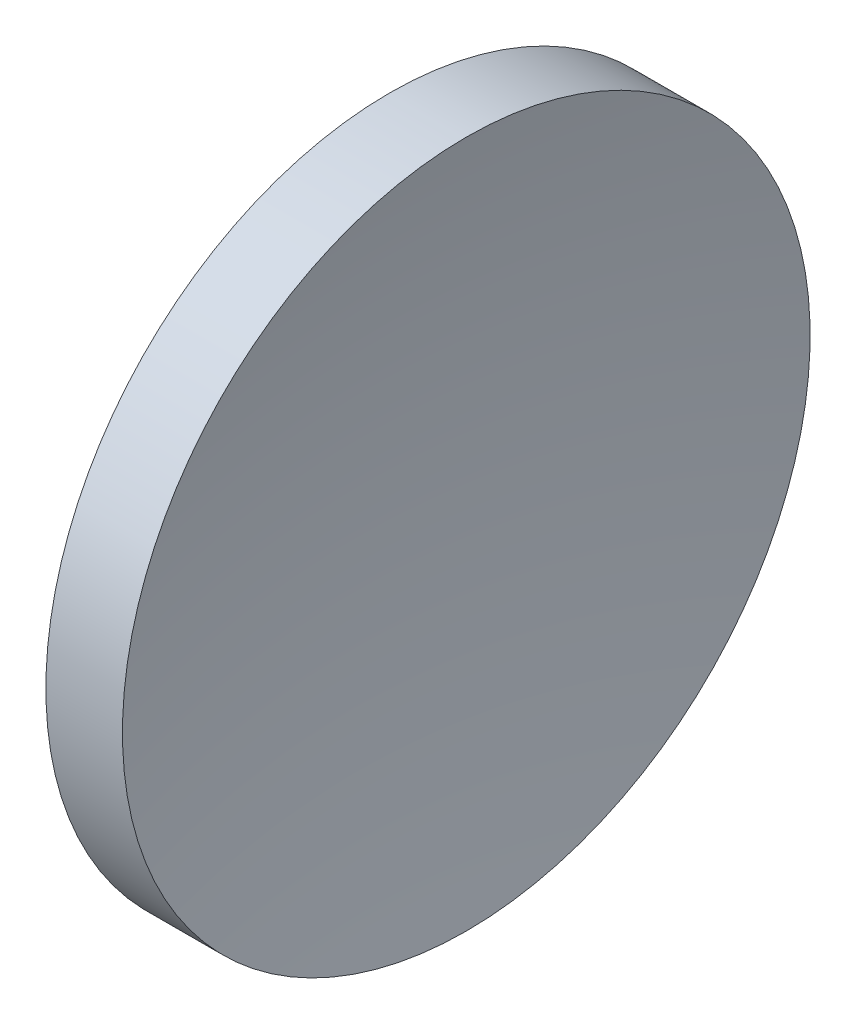
ISO-10303-21;
HEADER;
FILE_DESCRIPTION(('STEP AP214'),'2;1');
FILE_NAME('part.step','',(''),(''),'','','');
FILE_SCHEMA(('AUTOMOTIVE_DESIGN { 1 0 10303 214 1 1 1 1 }'));
ENDSEC;
DATA;
#1=APPLICATION_CONTEXT('core data for automotive mechanical design processes');
#2=APPLICATION_PROTOCOL_DEFINITION('international standard','automotive_design',2000,#1);
#3=PRODUCT_CONTEXT('',#1,'mechanical');
#4=PRODUCT('Part','Part','',(#3));
#5=PRODUCT_RELATED_PRODUCT_CATEGORY('part','',(#4));
#6=PRODUCT_DEFINITION_FORMATION('','',#4);
#7=PRODUCT_DEFINITION_CONTEXT('part definition',#1,'design');
#8=PRODUCT_DEFINITION('design','',#6,#7);
#9=PRODUCT_DEFINITION_SHAPE('','',#8);
#10=(LENGTH_UNIT() NAMED_UNIT(*) SI_UNIT(.MILLI.,.METRE.));
#11=(NAMED_UNIT(*) PLANE_ANGLE_UNIT() SI_UNIT($,.RADIAN.));
#12=(NAMED_UNIT(*) SI_UNIT($,.STERADIAN.) SOLID_ANGLE_UNIT());
#13=UNCERTAINTY_MEASURE_WITH_UNIT(LENGTH_MEASURE(1.E-05),#10,'distance_accuracy_value','');
#14=(GEOMETRIC_REPRESENTATION_CONTEXT(3) GLOBAL_UNCERTAINTY_ASSIGNED_CONTEXT((#13)) GLOBAL_UNIT_ASSIGNED_CONTEXT((#10,
#11,#12)) REPRESENTATION_CONTEXT('',''));
#15=CARTESIAN_POINT('',(0.,0.,0.));
#16=DIRECTION('',(0.,0.,1.));
#17=DIRECTION('',(1.,0.,0.));
#18=AXIS2_PLACEMENT_3D('',#15,#16,#17);
#19=CARTESIAN_POINT('',(220.755447260186,65.1574518265862,0.));
#20=DIRECTION('',(-1.,0.,0.));
#21=DIRECTION('',(0.,-1.,0.));
#22=AXIS2_PLACEMENT_3D('',#19,#20,#21);
#23=SPHERICAL_SURFACE('',#22,103.28);
#24=CARTESIAN_POINT('',(119.430433566627,65.1574518265862,0.));
#25=DIRECTION('',(-1.,0.,0.));
#26=DIRECTION('',(0.,-1.,0.));
#27=AXIS2_PLACEMENT_3D('',#24,#25,#26);
#28=CIRCLE('',#27,20.);
#29=CARTESIAN_POINT('',(119.430433566627,45.1574518265862,0.));
#30=VERTEX_POINT('',#29);
#31=EDGE_CURVE('E10',#30,#30,#28,.T.);
#32=ORIENTED_EDGE('',*,*,#31,.F.);
#33=EDGE_LOOP('',(#32));
#34=FACE_BOUND('',#33,.T.);
#35=ADVANCED_FACE('F35',(#34),#23,.F.);
#36=CARTESIAN_POINT('',(110.014789248842,65.1574518265862,0.));
#37=DIRECTION('',(-1.,0.,0.));
#38=DIRECTION('',(0.,-1.,0.));
#39=AXIS2_PLACEMENT_3D('',#36,#37,#38);
#40=CYLINDRICAL_SURFACE('',#39,20.);
#41=CARTESIAN_POINT('',(114.975447260186,65.1574518265862,0.));
#42=DIRECTION('',(-1.,0.,0.));
#43=DIRECTION('',(0.,-1.,0.));
#44=AXIS2_PLACEMENT_3D('',#41,#42,#43);
#45=CIRCLE('',#44,20.);
#46=CARTESIAN_POINT('',(114.975447260186,45.1574518265862,0.));
#47=VERTEX_POINT('',#46);
#48=EDGE_CURVE('E41',#47,#47,#45,.T.);
#49=ORIENTED_EDGE('',*,*,#48,.F.);
#50=EDGE_LOOP('',(#49));
#51=FACE_BOUND('',#50,.T.);
#52=ORIENTED_EDGE('',*,*,#31,.T.);
#53=EDGE_LOOP('',(#52));
#54=FACE_BOUND('',#53,.T.);
#55=ADVANCED_FACE('F49',(#51,#54),#40,.T.);
#56=CARTESIAN_POINT('',(114.975447260186,65.1574518265862,0.));
#57=DIRECTION('',(1.,0.,0.));
#58=DIRECTION('',(0.,1.,0.));
#59=AXIS2_PLACEMENT_3D('',#56,#57,#58);
#60=PLANE('',#59);
#61=ORIENTED_EDGE('',*,*,#48,.T.);
#62=EDGE_LOOP('',(#61));
#63=FACE_BOUND('',#62,.T.);
#64=ADVANCED_FACE('F47',(#63),#60,.F.);
#65=CLOSED_SHELL('',(#35,#55,#64));
#66=MANIFOLD_SOLID_BREP('B2',#65);
#67=ADVANCED_BREP_SHAPE_REPRESENTATION('',(#18,#66),#14);
#68=SHAPE_DEFINITION_REPRESENTATION(#9,#67);
ENDSEC;
END-ISO-10303-21;
